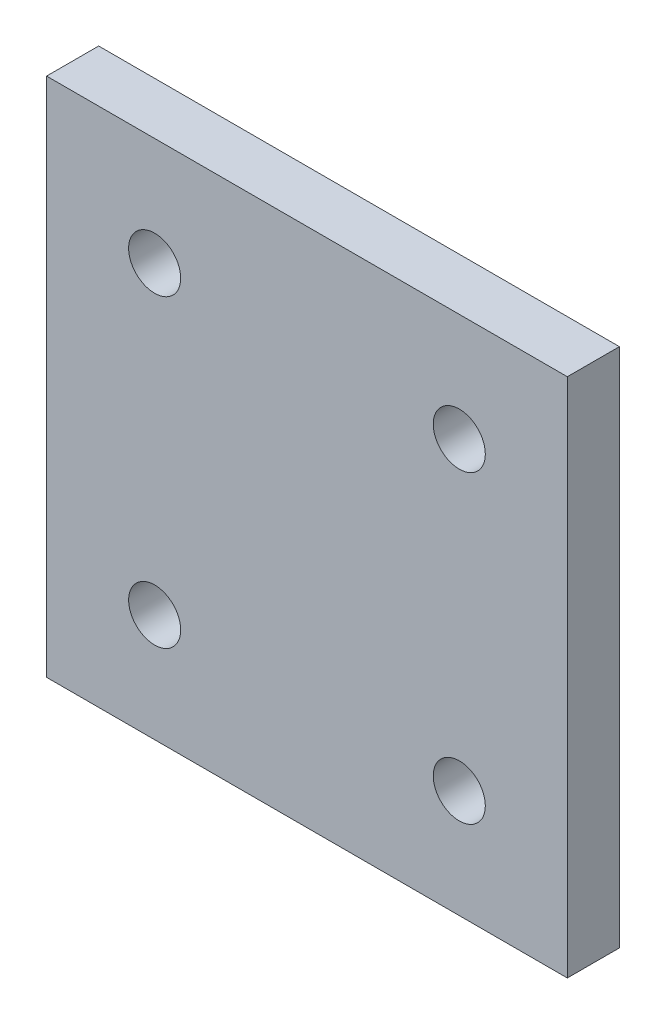
ISO-10303-21;
HEADER;
FILE_DESCRIPTION(('STEP AP214'),'2;1');
FILE_NAME('part.step','',(''),(''),'','','');
FILE_SCHEMA(('AUTOMOTIVE_DESIGN { 1 0 10303 214 1 1 1 1 }'));
ENDSEC;
DATA;
#1=APPLICATION_CONTEXT('core data for automotive mechanical design processes');
#2=APPLICATION_PROTOCOL_DEFINITION('international standard','automotive_design',2000,#1);
#3=PRODUCT_CONTEXT('',#1,'mechanical');
#4=PRODUCT('Part','Part','',(#3));
#5=PRODUCT_RELATED_PRODUCT_CATEGORY('part','',(#4));
#6=PRODUCT_DEFINITION_FORMATION('','',#4);
#7=PRODUCT_DEFINITION_CONTEXT('part definition',#1,'design');
#8=PRODUCT_DEFINITION('design','',#6,#7);
#9=PRODUCT_DEFINITION_SHAPE('','',#8);
#10=(LENGTH_UNIT() NAMED_UNIT(*) SI_UNIT(.MILLI.,.METRE.));
#11=(NAMED_UNIT(*) PLANE_ANGLE_UNIT() SI_UNIT($,.RADIAN.));
#12=(NAMED_UNIT(*) SI_UNIT($,.STERADIAN.) SOLID_ANGLE_UNIT());
#13=UNCERTAINTY_MEASURE_WITH_UNIT(LENGTH_MEASURE(1.E-05),#10,'distance_accuracy_value','');
#14=(GEOMETRIC_REPRESENTATION_CONTEXT(3) GLOBAL_UNCERTAINTY_ASSIGNED_CONTEXT((#13)) GLOBAL_UNIT_ASSIGNED_CONTEXT((#10,
#11,#12)) REPRESENTATION_CONTEXT('',''));
#15=CARTESIAN_POINT('',(0.,0.,0.));
#16=DIRECTION('',(0.,0.,1.));
#17=DIRECTION('',(1.,0.,0.));
#18=AXIS2_PLACEMENT_3D('',#15,#16,#17);
#19=CARTESIAN_POINT('',(45.6179256273205,-44.7856012172345,12.));
#20=DIRECTION('',(0.,0.,-1.));
#21=DIRECTION('',(-1.,0.,0.));
#22=AXIS2_PLACEMENT_3D('',#19,#20,#21);
#23=CYLINDRICAL_SURFACE('',#22,6.);
#24=CARTESIAN_POINT('',(45.6179256273205,-44.7856012172345,12.));
#25=DIRECTION('',(0.,0.,1.));
#26=DIRECTION('',(1.,0.,0.));
#27=AXIS2_PLACEMENT_3D('',#24,#25,#26);
#28=CIRCLE('',#27,6.);
#29=CARTESIAN_POINT('',(51.6179256273205,-44.7856012172345,12.));
#30=VERTEX_POINT('',#29);
#31=EDGE_CURVE('E11',#30,#30,#28,.T.);
#32=ORIENTED_EDGE('',*,*,#31,.T.);
#33=EDGE_LOOP('',(#32));
#34=FACE_BOUND('',#33,.T.);
#35=CARTESIAN_POINT('',(45.6179256273205,-44.7856012172345,0.));
#36=DIRECTION('',(0.,0.,1.));
#37=DIRECTION('',(1.,0.,0.));
#38=AXIS2_PLACEMENT_3D('',#35,#36,#37);
#39=CIRCLE('',#38,6.);
#40=CARTESIAN_POINT('',(51.6179256273205,-44.7856012172345,0.));
#41=VERTEX_POINT('',#40);
#42=EDGE_CURVE('E39',#41,#41,#39,.T.);
#43=ORIENTED_EDGE('',*,*,#42,.F.);
#44=EDGE_LOOP('',(#43));
#45=FACE_BOUND('',#44,.T.);
#46=ADVANCED_FACE('F35',(#34,#45),#23,.F.);
#47=CARTESIAN_POINT('',(-24.5830844994561,-44.7856012172345,12.));
#48=DIRECTION('',(0.,0.,-1.));
#49=DIRECTION('',(-1.,0.,0.));
#50=AXIS2_PLACEMENT_3D('',#47,#48,#49);
#51=CYLINDRICAL_SURFACE('',#50,6.);
#52=CARTESIAN_POINT('',(-24.5830844994561,-44.7856012172345,12.));
#53=DIRECTION('',(0.,0.,1.));
#54=DIRECTION('',(1.,0.,0.));
#55=AXIS2_PLACEMENT_3D('',#52,#53,#54);
#56=CIRCLE('',#55,6.);
#57=CARTESIAN_POINT('',(-18.5830844994561,-44.7856012172345,12.));
#58=VERTEX_POINT('',#57);
#59=EDGE_CURVE('E45',#58,#58,#56,.T.);
#60=ORIENTED_EDGE('',*,*,#59,.T.);
#61=EDGE_LOOP('',(#60));
#62=FACE_BOUND('',#61,.T.);
#63=CARTESIAN_POINT('',(-24.5830844994561,-44.7856012172345,0.));
#64=DIRECTION('',(0.,0.,1.));
#65=DIRECTION('',(1.,0.,0.));
#66=AXIS2_PLACEMENT_3D('',#63,#64,#65);
#67=CIRCLE('',#66,6.);
#68=CARTESIAN_POINT('',(-18.5830844994561,-44.7856012172345,0.));
#69=VERTEX_POINT('',#68);
#70=EDGE_CURVE('E129',#69,#69,#67,.T.);
#71=ORIENTED_EDGE('',*,*,#70,.F.);
#72=EDGE_LOOP('',(#71));
#73=FACE_BOUND('',#72,.T.);
#74=ADVANCED_FACE('F138',(#62,#73),#51,.F.);
#75=CARTESIAN_POINT('',(-24.5830844994562,25.4154089095422,12.));
#76=DIRECTION('',(0.,0.,-1.));
#77=DIRECTION('',(-1.,0.,0.));
#78=AXIS2_PLACEMENT_3D('',#75,#76,#77);
#79=CYLINDRICAL_SURFACE('',#78,6.);
#80=CARTESIAN_POINT('',(-24.5830844994562,25.4154089095422,12.));
#81=DIRECTION('',(0.,0.,1.));
#82=DIRECTION('',(1.,0.,0.));
#83=AXIS2_PLACEMENT_3D('',#80,#81,#82);
#84=CIRCLE('',#83,6.);
#85=CARTESIAN_POINT('',(-18.5830844994562,25.4154089095422,12.));
#86=VERTEX_POINT('',#85);
#87=EDGE_CURVE('E120',#86,#86,#84,.T.);
#88=ORIENTED_EDGE('',*,*,#87,.T.);
#89=EDGE_LOOP('',(#88));
#90=FACE_BOUND('',#89,.T.);
#91=CARTESIAN_POINT('',(-24.5830844994562,25.4154089095422,0.));
#92=DIRECTION('',(0.,0.,1.));
#93=DIRECTION('',(1.,0.,0.));
#94=AXIS2_PLACEMENT_3D('',#91,#92,#93);
#95=CIRCLE('',#94,6.);
#96=CARTESIAN_POINT('',(-18.5830844994562,25.4154089095422,0.));
#97=VERTEX_POINT('',#96);
#98=EDGE_CURVE('E127',#97,#97,#95,.T.);
#99=ORIENTED_EDGE('',*,*,#98,.F.);
#100=EDGE_LOOP('',(#99));
#101=FACE_BOUND('',#100,.T.);
#102=ADVANCED_FACE('F144',(#90,#101),#79,.F.);
#103=CARTESIAN_POINT('',(45.6179256273205,25.4154089095422,12.));
#104=DIRECTION('',(0.,0.,-1.));
#105=DIRECTION('',(-1.,0.,0.));
#106=AXIS2_PLACEMENT_3D('',#103,#104,#105);
#107=CYLINDRICAL_SURFACE('',#106,5.99999999999999);
#108=CARTESIAN_POINT('',(45.6179256273205,25.4154089095422,12.));
#109=DIRECTION('',(0.,0.,1.));
#110=DIRECTION('',(1.,0.,0.));
#111=AXIS2_PLACEMENT_3D('',#108,#109,#110);
#112=CIRCLE('',#111,5.99999999999999);
#113=CARTESIAN_POINT('',(51.6179256273205,25.4154089095422,12.));
#114=VERTEX_POINT('',#113);
#115=EDGE_CURVE('E117',#114,#114,#112,.T.);
#116=ORIENTED_EDGE('',*,*,#115,.T.);
#117=EDGE_LOOP('',(#116));
#118=FACE_BOUND('',#117,.T.);
#119=CARTESIAN_POINT('',(45.6179256273205,25.4154089095422,0.));
#120=DIRECTION('',(0.,0.,1.));
#121=DIRECTION('',(1.,0.,0.));
#122=AXIS2_PLACEMENT_3D('',#119,#120,#121);
#123=CIRCLE('',#122,5.99999999999999);
#124=CARTESIAN_POINT('',(51.6179256273205,25.4154089095422,0.));
#125=VERTEX_POINT('',#124);
#126=EDGE_CURVE('E114',#125,#125,#123,.T.);
#127=ORIENTED_EDGE('',*,*,#126,.F.);
#128=EDGE_LOOP('',(#127));
#129=FACE_BOUND('',#128,.T.);
#130=ADVANCED_FACE('F37',(#118,#129),#107,.F.);
#131=CARTESIAN_POINT('',(0.,0.,12.));
#132=DIRECTION('',(0.,0.,1.));
#133=DIRECTION('',(1.,0.,0.));
#134=AXIS2_PLACEMENT_3D('',#131,#132,#133);
#135=PLANE('',#134);
#136=ORIENTED_EDGE('',*,*,#115,.F.);
#137=EDGE_LOOP('',(#136));
#138=FACE_BOUND('',#137,.T.);
#139=ORIENTED_EDGE('',*,*,#87,.F.);
#140=EDGE_LOOP('',(#139));
#141=FACE_BOUND('',#140,.T.);
#142=ORIENTED_EDGE('',*,*,#59,.F.);
#143=EDGE_LOOP('',(#142));
#144=FACE_BOUND('',#143,.T.);
#145=ORIENTED_EDGE('',*,*,#31,.F.);
#146=EDGE_LOOP('',(#145));
#147=FACE_BOUND('',#146,.T.);
#148=DIRECTION('',(0.,-1.,0.));
#149=VECTOR('',#148,1.);
#150=CARTESIAN_POINT('',(-49.4825794360678,-69.6850961538462,12.));
#151=LINE('',#150,#149);
#152=CARTESIAN_POINT('',(-49.4825794360678,50.3149038461538,12.));
#153=VERTEX_POINT('',#152);
#154=CARTESIAN_POINT('',(-49.4825794360678,-69.6850961538462,12.));
#155=VERTEX_POINT('',#154);
#156=EDGE_CURVE('E105',#153,#155,#151,.T.);
#157=ORIENTED_EDGE('',*,*,#156,.T.);
#158=DIRECTION('',(1.,0.,0.));
#159=VECTOR('',#158,1.);
#160=CARTESIAN_POINT('',(70.5174205639322,-69.6850961538462,12.));
#161=LINE('',#160,#159);
#162=CARTESIAN_POINT('',(70.5174205639322,-69.6850961538462,12.));
#163=VERTEX_POINT('',#162);
#164=EDGE_CURVE('E108',#155,#163,#161,.T.);
#165=ORIENTED_EDGE('',*,*,#164,.T.);
#166=DIRECTION('',(0.,1.,0.));
#167=VECTOR('',#166,1.);
#168=CARTESIAN_POINT('',(70.5174205639322,50.3149038461538,12.));
#169=LINE('',#168,#167);
#170=CARTESIAN_POINT('',(70.5174205639322,50.3149038461538,12.));
#171=VERTEX_POINT('',#170);
#172=EDGE_CURVE('E90',#163,#171,#169,.T.);
#173=ORIENTED_EDGE('',*,*,#172,.T.);
#174=DIRECTION('',(-1.,0.,0.));
#175=VECTOR('',#174,1.);
#176=CARTESIAN_POINT('',(70.5174205639322,50.3149038461538,12.));
#177=LINE('',#176,#175);
#178=EDGE_CURVE('E101',#171,#153,#177,.T.);
#179=ORIENTED_EDGE('',*,*,#178,.T.);
#180=EDGE_LOOP('',(#157,#165,#173,#179));
#181=FACE_BOUND('',#180,.T.);
#182=ADVANCED_FACE('F154',(#138,#141,#144,#147,#181),#135,.T.);
#183=CARTESIAN_POINT('',(0.,0.,0.));
#184=DIRECTION('',(0.,0.,1.));
#185=DIRECTION('',(1.,0.,0.));
#186=AXIS2_PLACEMENT_3D('',#183,#184,#185);
#187=PLANE('',#186);
#188=ORIENTED_EDGE('',*,*,#126,.T.);
#189=EDGE_LOOP('',(#188));
#190=FACE_BOUND('',#189,.T.);
#191=ORIENTED_EDGE('',*,*,#98,.T.);
#192=EDGE_LOOP('',(#191));
#193=FACE_BOUND('',#192,.T.);
#194=ORIENTED_EDGE('',*,*,#70,.T.);
#195=EDGE_LOOP('',(#194));
#196=FACE_BOUND('',#195,.T.);
#197=ORIENTED_EDGE('',*,*,#42,.T.);
#198=EDGE_LOOP('',(#197));
#199=FACE_BOUND('',#198,.T.);
#200=DIRECTION('',(0.,-1.,0.));
#201=VECTOR('',#200,1.);
#202=CARTESIAN_POINT('',(-49.4825794360678,-69.6850961538462,0.));
#203=LINE('',#202,#201);
#204=CARTESIAN_POINT('',(-49.4825794360678,50.3149038461538,0.));
#205=VERTEX_POINT('',#204);
#206=CARTESIAN_POINT('',(-49.4825794360678,-69.6850961538462,0.));
#207=VERTEX_POINT('',#206);
#208=EDGE_CURVE('E99',#205,#207,#203,.T.);
#209=ORIENTED_EDGE('',*,*,#208,.F.);
#210=DIRECTION('',(-1.,0.,0.));
#211=VECTOR('',#210,1.);
#212=CARTESIAN_POINT('',(70.5174205639322,50.3149038461538,0.));
#213=LINE('',#212,#211);
#214=CARTESIAN_POINT('',(70.5174205639322,50.3149038461538,0.));
#215=VERTEX_POINT('',#214);
#216=EDGE_CURVE('E96',#215,#205,#213,.T.);
#217=ORIENTED_EDGE('',*,*,#216,.F.);
#218=DIRECTION('',(0.,1.,0.));
#219=VECTOR('',#218,1.);
#220=CARTESIAN_POINT('',(70.5174205639322,50.3149038461538,0.));
#221=LINE('',#220,#219);
#222=CARTESIAN_POINT('',(70.5174205639322,-69.6850961538462,0.));
#223=VERTEX_POINT('',#222);
#224=EDGE_CURVE('E88',#223,#215,#221,.T.);
#225=ORIENTED_EDGE('',*,*,#224,.F.);
#226=DIRECTION('',(1.,0.,0.));
#227=VECTOR('',#226,1.);
#228=CARTESIAN_POINT('',(70.5174205639322,-69.6850961538462,0.));
#229=LINE('',#228,#227);
#230=EDGE_CURVE('E95',#207,#223,#229,.T.);
#231=ORIENTED_EDGE('',*,*,#230,.F.);
#232=EDGE_LOOP('',(#209,#217,#225,#231));
#233=FACE_BOUND('',#232,.T.);
#234=ADVANCED_FACE('F94',(#190,#193,#196,#199,#233),#187,.F.);
#235=CARTESIAN_POINT('',(-49.4825794360678,-69.6850961538462,0.));
#236=DIRECTION('',(-1.,0.,0.));
#237=DIRECTION('',(0.,-1.,0.));
#238=AXIS2_PLACEMENT_3D('',#235,#236,#237);
#239=PLANE('',#238);
#240=ORIENTED_EDGE('',*,*,#156,.F.);
#241=DIRECTION('',(0.,0.,1.));
#242=VECTOR('',#241,1.);
#243=CARTESIAN_POINT('',(-49.4825794360678,50.3149038461538,0.));
#244=LINE('',#243,#242);
#245=EDGE_CURVE('E54',#205,#153,#244,.T.);
#246=ORIENTED_EDGE('',*,*,#245,.F.);
#247=ORIENTED_EDGE('',*,*,#208,.T.);
#248=DIRECTION('',(0.,0.,1.));
#249=VECTOR('',#248,1.);
#250=CARTESIAN_POINT('',(-49.4825794360678,-69.6850961538462,0.));
#251=LINE('',#250,#249);
#252=EDGE_CURVE('E82',#207,#155,#251,.T.);
#253=ORIENTED_EDGE('',*,*,#252,.T.);
#254=EDGE_LOOP('',(#240,#246,#247,#253));
#255=FACE_BOUND('',#254,.T.);
#256=ADVANCED_FACE('F161',(#255),#239,.T.);
#257=CARTESIAN_POINT('',(70.5174205639322,50.3149038461538,0.));
#258=DIRECTION('',(0.,1.,0.));
#259=DIRECTION('',(0.,0.,1.));
#260=AXIS2_PLACEMENT_3D('',#257,#258,#259);
#261=PLANE('',#260);
#262=ORIENTED_EDGE('',*,*,#178,.F.);
#263=DIRECTION('',(0.,0.,1.));
#264=VECTOR('',#263,1.);
#265=CARTESIAN_POINT('',(70.5174205639322,50.3149038461538,0.));
#266=LINE('',#265,#264);
#267=EDGE_CURVE('E71',#215,#171,#266,.T.);
#268=ORIENTED_EDGE('',*,*,#267,.F.);
#269=ORIENTED_EDGE('',*,*,#216,.T.);
#270=ORIENTED_EDGE('',*,*,#245,.T.);
#271=EDGE_LOOP('',(#262,#268,#269,#270));
#272=FACE_BOUND('',#271,.T.);
#273=ADVANCED_FACE('F167',(#272),#261,.T.);
#274=CARTESIAN_POINT('',(70.5174205639322,50.3149038461538,0.));
#275=DIRECTION('',(1.,0.,0.));
#276=DIRECTION('',(0.,1.,0.));
#277=AXIS2_PLACEMENT_3D('',#274,#275,#276);
#278=PLANE('',#277);
#279=ORIENTED_EDGE('',*,*,#172,.F.);
#280=DIRECTION('',(0.,0.,1.));
#281=VECTOR('',#280,1.);
#282=CARTESIAN_POINT('',(70.5174205639322,-69.6850961538462,0.));
#283=LINE('',#282,#281);
#284=EDGE_CURVE('E85',#223,#163,#283,.T.);
#285=ORIENTED_EDGE('',*,*,#284,.F.);
#286=ORIENTED_EDGE('',*,*,#224,.T.);
#287=ORIENTED_EDGE('',*,*,#267,.T.);
#288=EDGE_LOOP('',(#279,#285,#286,#287));
#289=FACE_BOUND('',#288,.T.);
#290=ADVANCED_FACE('F87',(#289),#278,.T.);
#291=CARTESIAN_POINT('',(70.5174205639322,-69.6850961538462,0.));
#292=DIRECTION('',(0.,-1.,0.));
#293=DIRECTION('',(0.,0.,-1.));
#294=AXIS2_PLACEMENT_3D('',#291,#292,#293);
#295=PLANE('',#294);
#296=ORIENTED_EDGE('',*,*,#164,.F.);
#297=ORIENTED_EDGE('',*,*,#252,.F.);
#298=ORIENTED_EDGE('',*,*,#230,.T.);
#299=ORIENTED_EDGE('',*,*,#284,.T.);
#300=EDGE_LOOP('',(#296,#297,#298,#299));
#301=FACE_BOUND('',#300,.T.);
#302=ADVANCED_FACE('F98',(#301),#295,.T.);
#303=CLOSED_SHELL('',(#46,#74,#102,#130,#182,#234,#256,#273,#290,#302));
#304=MANIFOLD_SOLID_BREP('B2',#303);
#305=ADVANCED_BREP_SHAPE_REPRESENTATION('',(#18,#304),#14);
#306=SHAPE_DEFINITION_REPRESENTATION(#9,#305);
ENDSEC;
END-ISO-10303-21;
